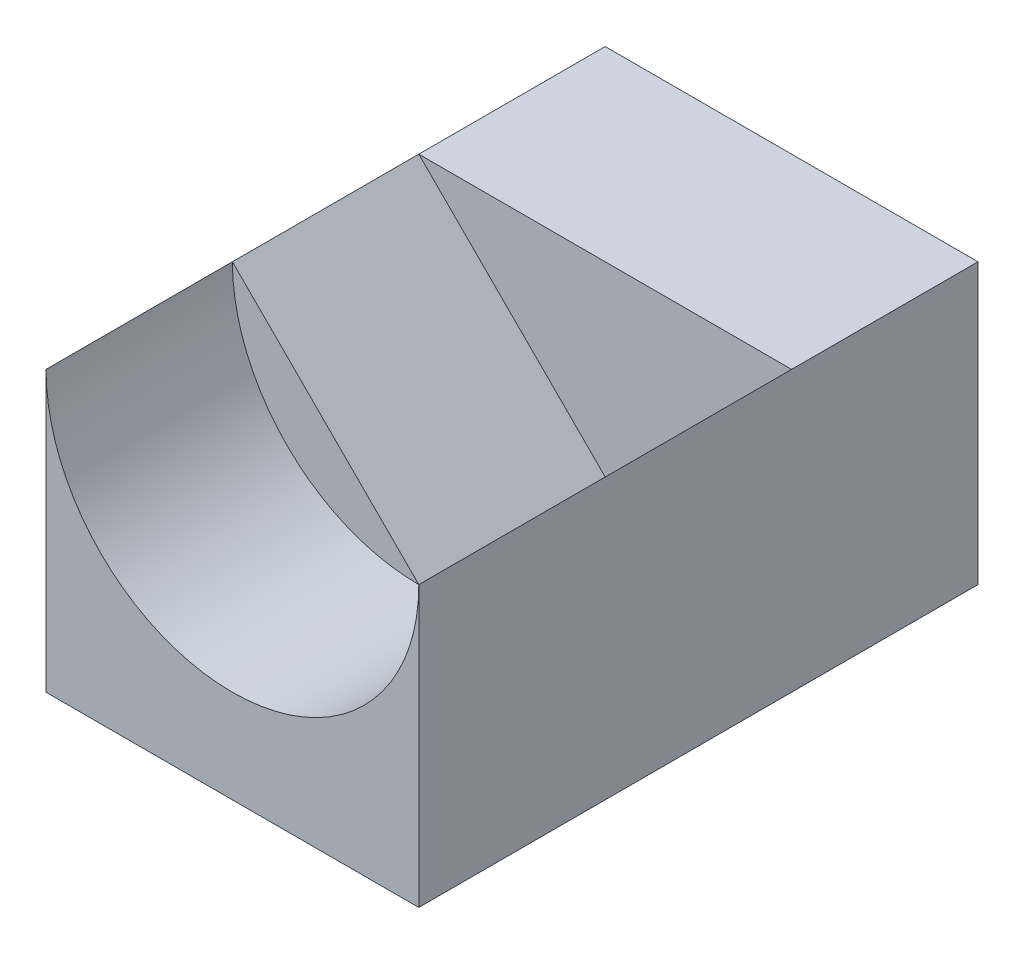
ISO-10303-21;
HEADER;
FILE_DESCRIPTION(('STEP AP214'),'2;1');
FILE_NAME('part.step','',(''),(''),'','','');
FILE_SCHEMA(('AUTOMOTIVE_DESIGN { 1 0 10303 214 1 1 1 1 }'));
ENDSEC;
DATA;
#1=APPLICATION_CONTEXT('core data for automotive mechanical design processes');
#2=APPLICATION_PROTOCOL_DEFINITION('international standard','automotive_design',2000,#1);
#3=PRODUCT_CONTEXT('',#1,'mechanical');
#4=PRODUCT('Part','Part','',(#3));
#5=PRODUCT_RELATED_PRODUCT_CATEGORY('part','',(#4));
#6=PRODUCT_DEFINITION_FORMATION('','',#4);
#7=PRODUCT_DEFINITION_CONTEXT('part definition',#1,'design');
#8=PRODUCT_DEFINITION('design','',#6,#7);
#9=PRODUCT_DEFINITION_SHAPE('','',#8);
#10=(LENGTH_UNIT() NAMED_UNIT(*) SI_UNIT(.MILLI.,.METRE.));
#11=(NAMED_UNIT(*) PLANE_ANGLE_UNIT() SI_UNIT($,.RADIAN.));
#12=(NAMED_UNIT(*) SI_UNIT($,.STERADIAN.) SOLID_ANGLE_UNIT());
#13=UNCERTAINTY_MEASURE_WITH_UNIT(LENGTH_MEASURE(1.E-05),#10,'distance_accuracy_value','');
#14=(GEOMETRIC_REPRESENTATION_CONTEXT(3) GLOBAL_UNCERTAINTY_ASSIGNED_CONTEXT((#13)) GLOBAL_UNIT_ASSIGNED_CONTEXT((#10,
#11,#12)) REPRESENTATION_CONTEXT('',''));
#15=CARTESIAN_POINT('',(0.,0.,0.));
#16=DIRECTION('',(0.,0.,1.));
#17=DIRECTION('',(1.,0.,0.));
#18=AXIS2_PLACEMENT_3D('',#15,#16,#17);
#19=CARTESIAN_POINT('',(0.,15.,0.));
#20=DIRECTION('',(0.,-1.,0.));
#21=DIRECTION('',(0.,0.,-1.));
#22=AXIS2_PLACEMENT_3D('',#19,#20,#21);
#23=PLANE('',#22);
#24=DIRECTION('',(-1.,0.,0.));
#25=VECTOR('',#24,1.);
#26=CARTESIAN_POINT('',(10.,15.,-5.));
#27=LINE('',#26,#25);
#28=CARTESIAN_POINT('',(10.,15.,-5.));
#29=VERTEX_POINT('',#28);
#30=CARTESIAN_POINT('',(-10.,15.,-5.));
#31=VERTEX_POINT('',#30);
#32=EDGE_CURVE('E149',#29,#31,#27,.T.);
#33=ORIENTED_EDGE('',*,*,#32,.F.);
#34=DIRECTION('',(0.,0.,-1.));
#35=VECTOR('',#34,1.);
#36=CARTESIAN_POINT('',(10.,15.,-15.));
#37=LINE('',#36,#35);
#38=CARTESIAN_POINT('',(10.,15.,-15.));
#39=VERTEX_POINT('',#38);
#40=EDGE_CURVE('E158',#29,#39,#37,.T.);
#41=ORIENTED_EDGE('',*,*,#40,.T.);
#42=DIRECTION('',(-1.,0.,0.));
#43=VECTOR('',#42,1.);
#44=CARTESIAN_POINT('',(10.,15.,-15.));
#45=LINE('',#44,#43);
#46=CARTESIAN_POINT('',(-10.,15.,-15.));
#47=VERTEX_POINT('',#46);
#48=EDGE_CURVE('E54',#39,#47,#45,.T.);
#49=ORIENTED_EDGE('',*,*,#48,.T.);
#50=DIRECTION('',(0.,0.,1.));
#51=VECTOR('',#50,1.);
#52=CARTESIAN_POINT('',(-10.,15.,-15.));
#53=LINE('',#52,#51);
#54=EDGE_CURVE('E84',#47,#31,#53,.T.);
#55=ORIENTED_EDGE('',*,*,#54,.T.);
#56=EDGE_LOOP('',(#33,#41,#49,#55));
#57=FACE_BOUND('',#56,.T.);
#58=ADVANCED_FACE('F37',(#57),#23,.F.);
#59=CARTESIAN_POINT('',(0.,15.,5.));
#60=DIRECTION('',(0.,0.,1.));
#61=DIRECTION('',(1.,0.,0.));
#62=AXIS2_PLACEMENT_3D('',#59,#60,#61);
#63=PLANE('',#62);
#64=DIRECTION('',(0.707106781186548,0.707106781186548,0.));
#65=VECTOR('',#64,1.);
#66=CARTESIAN_POINT('',(0.,5.,5.));
#67=LINE('',#66,#65);
#68=CARTESIAN_POINT('',(0.,5.,5.));
#69=VERTEX_POINT('',#68);
#70=CARTESIAN_POINT('',(10.,15.,5.));
#71=VERTEX_POINT('',#70);
#72=EDGE_CURVE('E154',#69,#71,#67,.T.);
#73=ORIENTED_EDGE('',*,*,#72,.F.);
#74=CARTESIAN_POINT('',(0.,15.,5.));
#75=DIRECTION('',(0.,0.,1.));
#76=DIRECTION('',(1.,0.,0.));
#77=AXIS2_PLACEMENT_3D('',#74,#75,#76);
#78=CIRCLE('',#77,10.);
#79=EDGE_CURVE('E170',#69,#71,#78,.T.);
#80=ORIENTED_EDGE('',*,*,#79,.T.);
#81=EDGE_LOOP('',(#73,#80));
#82=FACE_BOUND('',#81,.T.);
#83=ADVANCED_FACE('F171',(#82),#63,.T.);
#84=CARTESIAN_POINT('',(-10.,15.,-15.));
#85=DIRECTION('',(1.,0.,0.));
#86=DIRECTION('',(0.,0.,-1.));
#87=AXIS2_PLACEMENT_3D('',#84,#85,#86);
#88=PLANE('',#87);
#89=DIRECTION('',(0.,0.,1.));
#90=VECTOR('',#89,1.);
#91=CARTESIAN_POINT('',(-10.,0.,-15.));
#92=LINE('',#91,#90);
#93=CARTESIAN_POINT('',(-10.,0.,-15.));
#94=VERTEX_POINT('',#93);
#95=CARTESIAN_POINT('',(-10.,0.,15.));
#96=VERTEX_POINT('',#95);
#97=EDGE_CURVE('E89',#94,#96,#92,.T.);
#98=ORIENTED_EDGE('',*,*,#97,.T.);
#99=DIRECTION('',(0.,-1.,0.));
#100=VECTOR('',#99,1.);
#101=CARTESIAN_POINT('',(-10.,15.,15.));
#102=LINE('',#101,#100);
#103=CARTESIAN_POINT('',(-10.,15.,15.));
#104=VERTEX_POINT('',#103);
#105=EDGE_CURVE('E11',#104,#96,#102,.T.);
#106=ORIENTED_EDGE('',*,*,#105,.F.);
#107=DIRECTION('',(0.,0.,1.));
#108=VECTOR('',#107,1.);
#109=CARTESIAN_POINT('',(-10.,15.,5.));
#110=LINE('',#109,#108);
#111=CARTESIAN_POINT('',(-10.,15.,5.));
#112=VERTEX_POINT('',#111);
#113=EDGE_CURVE('E94',#112,#104,#110,.T.);
#114=ORIENTED_EDGE('',*,*,#113,.F.);
#115=DIRECTION('',(0.,0.,1.));
#116=VECTOR('',#115,1.);
#117=CARTESIAN_POINT('',(-10.,15.,-5.));
#118=LINE('',#117,#116);
#119=EDGE_CURVE('E142',#31,#112,#118,.T.);
#120=ORIENTED_EDGE('',*,*,#119,.F.);
#121=ORIENTED_EDGE('',*,*,#54,.F.);
#122=DIRECTION('',(0.,-1.,0.));
#123=VECTOR('',#122,1.);
#124=CARTESIAN_POINT('',(-10.,15.,-15.));
#125=LINE('',#124,#123);
#126=EDGE_CURVE('E79',#47,#94,#125,.T.);
#127=ORIENTED_EDGE('',*,*,#126,.T.);
#128=EDGE_LOOP('',(#98,#106,#114,#120,#121,#127));
#129=FACE_BOUND('',#128,.T.);
#130=ADVANCED_FACE('F39',(#129),#88,.F.);
#131=CARTESIAN_POINT('',(10.,15.,15.));
#132=DIRECTION('',(0.,0.,-1.));
#133=DIRECTION('',(-1.,0.,0.));
#134=AXIS2_PLACEMENT_3D('',#131,#132,#133);
#135=PLANE('',#134);
#136=DIRECTION('',(0.,-1.,0.));
#137=VECTOR('',#136,1.);
#138=CARTESIAN_POINT('',(10.,15.,15.));
#139=LINE('',#138,#137);
#140=CARTESIAN_POINT('',(10.,15.,15.));
#141=VERTEX_POINT('',#140);
#142=CARTESIAN_POINT('',(10.,0.,15.));
#143=VERTEX_POINT('',#142);
#144=EDGE_CURVE('E46',#141,#143,#139,.T.);
#145=ORIENTED_EDGE('',*,*,#144,.F.);
#146=CARTESIAN_POINT('',(0.,15.,15.));
#147=DIRECTION('',(0.,0.,1.));
#148=DIRECTION('',(1.,0.,0.));
#149=AXIS2_PLACEMENT_3D('',#146,#147,#148);
#150=CIRCLE('',#149,10.);
#151=EDGE_CURVE('E116',#104,#141,#150,.T.);
#152=ORIENTED_EDGE('',*,*,#151,.F.);
#153=ORIENTED_EDGE('',*,*,#105,.T.);
#154=DIRECTION('',(1.,0.,0.));
#155=VECTOR('',#154,1.);
#156=CARTESIAN_POINT('',(10.,0.,15.));
#157=LINE('',#156,#155);
#158=EDGE_CURVE('E93',#96,#143,#157,.T.);
#159=ORIENTED_EDGE('',*,*,#158,.T.);
#160=EDGE_LOOP('',(#145,#152,#153,#159));
#161=FACE_BOUND('',#160,.T.);
#162=ADVANCED_FACE('F113',(#161),#135,.F.);
#163=CARTESIAN_POINT('',(10.,15.,-15.));
#164=DIRECTION('',(-1.,0.,0.));
#165=DIRECTION('',(0.,0.,1.));
#166=AXIS2_PLACEMENT_3D('',#163,#164,#165);
#167=PLANE('',#166);
#168=DIRECTION('',(0.,0.,-1.));
#169=VECTOR('',#168,1.);
#170=CARTESIAN_POINT('',(10.,0.,-15.));
#171=LINE('',#170,#169);
#172=CARTESIAN_POINT('',(10.,0.,-15.));
#173=VERTEX_POINT('',#172);
#174=EDGE_CURVE('E71',#143,#173,#171,.T.);
#175=ORIENTED_EDGE('',*,*,#174,.T.);
#176=DIRECTION('',(0.,-1.,0.));
#177=VECTOR('',#176,1.);
#178=CARTESIAN_POINT('',(10.,15.,-15.));
#179=LINE('',#178,#177);
#180=EDGE_CURVE('E81',#39,#173,#179,.T.);
#181=ORIENTED_EDGE('',*,*,#180,.F.);
#182=ORIENTED_EDGE('',*,*,#40,.F.);
#183=EDGE_CURVE('E160',#71,#29,#37,.T.);
#184=ORIENTED_EDGE('',*,*,#183,.F.);
#185=EDGE_CURVE('E110',#141,#71,#37,.T.);
#186=ORIENTED_EDGE('',*,*,#185,.F.);
#187=ORIENTED_EDGE('',*,*,#144,.T.);
#188=EDGE_LOOP('',(#175,#181,#182,#184,#186,#187));
#189=FACE_BOUND('',#188,.T.);
#190=ADVANCED_FACE('F106',(#189),#167,.F.);
#191=CARTESIAN_POINT('',(10.,15.,-15.));
#192=DIRECTION('',(0.,0.,1.));
#193=DIRECTION('',(1.,0.,0.));
#194=AXIS2_PLACEMENT_3D('',#191,#192,#193);
#195=PLANE('',#194);
#196=DIRECTION('',(-1.,0.,0.));
#197=VECTOR('',#196,1.);
#198=CARTESIAN_POINT('',(10.,0.,-15.));
#199=LINE('',#198,#197);
#200=EDGE_CURVE('E76',#173,#94,#199,.T.);
#201=ORIENTED_EDGE('',*,*,#200,.T.);
#202=ORIENTED_EDGE('',*,*,#126,.F.);
#203=ORIENTED_EDGE('',*,*,#48,.F.);
#204=ORIENTED_EDGE('',*,*,#180,.T.);
#205=EDGE_LOOP('',(#201,#202,#203,#204));
#206=FACE_BOUND('',#205,.T.);
#207=ADVANCED_FACE('F78',(#206),#195,.F.);
#208=CARTESIAN_POINT('',(0.,0.,0.));
#209=DIRECTION('',(0.,-1.,0.));
#210=DIRECTION('',(0.,0.,-1.));
#211=AXIS2_PLACEMENT_3D('',#208,#209,#210);
#212=PLANE('',#211);
#213=ORIENTED_EDGE('',*,*,#97,.F.);
#214=ORIENTED_EDGE('',*,*,#200,.F.);
#215=ORIENTED_EDGE('',*,*,#174,.F.);
#216=ORIENTED_EDGE('',*,*,#158,.F.);
#217=EDGE_LOOP('',(#213,#214,#215,#216));
#218=FACE_BOUND('',#217,.T.);
#219=ADVANCED_FACE('F92',(#218),#212,.T.);
#220=CARTESIAN_POINT('',(0.,15.,5.));
#221=DIRECTION('',(0.,0.,1.));
#222=DIRECTION('',(1.,0.,0.));
#223=AXIS2_PLACEMENT_3D('',#220,#221,#222);
#224=CYLINDRICAL_SURFACE('',#223,10.);
#225=ORIENTED_EDGE('',*,*,#151,.T.);
#226=ORIENTED_EDGE('',*,*,#185,.T.);
#227=ORIENTED_EDGE('',*,*,#79,.F.);
#228=EDGE_CURVE('E98',#112,#69,#78,.T.);
#229=ORIENTED_EDGE('',*,*,#228,.F.);
#230=ORIENTED_EDGE('',*,*,#113,.T.);
#231=EDGE_LOOP('',(#225,#226,#227,#229,#230));
#232=FACE_BOUND('',#231,.T.);
#233=ADVANCED_FACE('F180',(#232),#224,.F.);
#234=DIRECTION('',(0.707106781186547,-0.707106781186548,0.));
#235=VECTOR('',#234,1.);
#236=CARTESIAN_POINT('',(-10.,15.,5.));
#237=LINE('',#236,#235);
#238=EDGE_CURVE('E168',#112,#69,#237,.T.);
#239=ORIENTED_EDGE('',*,*,#238,.F.);
#240=ORIENTED_EDGE('',*,*,#228,.T.);
#241=EDGE_LOOP('',(#239,#240));
#242=FACE_BOUND('',#241,.T.);
#243=ADVANCED_FACE('F179',(#242),#63,.T.);
#244=CARTESIAN_POINT('',(0.,5.,-5.));
#245=DIRECTION('',(0.707106781186548,-0.707106781186548,0.));
#246=DIRECTION('',(0.707106781186548,0.707106781186548,0.));
#247=AXIS2_PLACEMENT_3D('',#244,#245,#246);
#248=PLANE('',#247);
#249=ORIENTED_EDGE('',*,*,#72,.T.);
#250=ORIENTED_EDGE('',*,*,#183,.T.);
#251=DIRECTION('',(0.707106781186548,0.707106781186548,0.));
#252=VECTOR('',#251,1.);
#253=CARTESIAN_POINT('',(0.,5.,-5.));
#254=LINE('',#253,#252);
#255=CARTESIAN_POINT('',(0.,5.,-5.));
#256=VERTEX_POINT('',#255);
#257=EDGE_CURVE('E148',#256,#29,#254,.T.);
#258=ORIENTED_EDGE('',*,*,#257,.F.);
#259=DIRECTION('',(0.,0.,1.));
#260=VECTOR('',#259,1.);
#261=CARTESIAN_POINT('',(0.,5.,-5.));
#262=LINE('',#261,#260);
#263=EDGE_CURVE('E144',#256,#69,#262,.T.);
#264=ORIENTED_EDGE('',*,*,#263,.T.);
#265=EDGE_LOOP('',(#249,#250,#258,#264));
#266=FACE_BOUND('',#265,.T.);
#267=ADVANCED_FACE('F164',(#266),#248,.F.);
#268=CARTESIAN_POINT('',(-10.,15.,-5.));
#269=DIRECTION('',(-0.707106781186548,-0.707106781186547,0.));
#270=DIRECTION('',(0.707106781186547,-0.707106781186548,0.));
#271=AXIS2_PLACEMENT_3D('',#268,#269,#270);
#272=PLANE('',#271);
#273=ORIENTED_EDGE('',*,*,#238,.T.);
#274=ORIENTED_EDGE('',*,*,#263,.F.);
#275=DIRECTION('',(0.707106781186547,-0.707106781186548,0.));
#276=VECTOR('',#275,1.);
#277=CARTESIAN_POINT('',(-10.,15.,-5.));
#278=LINE('',#277,#276);
#279=EDGE_CURVE('E138',#31,#256,#278,.T.);
#280=ORIENTED_EDGE('',*,*,#279,.F.);
#281=ORIENTED_EDGE('',*,*,#119,.T.);
#282=EDGE_LOOP('',(#273,#274,#280,#281));
#283=FACE_BOUND('',#282,.T.);
#284=ADVANCED_FACE('F141',(#283),#272,.F.);
#285=CARTESIAN_POINT('',(0.,0.,-5.));
#286=DIRECTION('',(0.,0.,1.));
#287=DIRECTION('',(1.,0.,0.));
#288=AXIS2_PLACEMENT_3D('',#285,#286,#287);
#289=PLANE('',#288);
#290=ORIENTED_EDGE('',*,*,#32,.T.);
#291=ORIENTED_EDGE('',*,*,#279,.T.);
#292=ORIENTED_EDGE('',*,*,#257,.T.);
#293=EDGE_LOOP('',(#290,#291,#292));
#294=FACE_BOUND('',#293,.T.);
#295=ADVANCED_FACE('F152',(#294),#289,.T.);
#296=CLOSED_SHELL('',(#58,#83,#130,#162,#190,#207,#219,#233,#243,#267,#284,#295));
#297=MANIFOLD_SOLID_BREP('B2',#296);
#298=ADVANCED_BREP_SHAPE_REPRESENTATION('',(#18,#297),#14);
#299=SHAPE_DEFINITION_REPRESENTATION(#9,#298);
ENDSEC;
END-ISO-10303-21;
